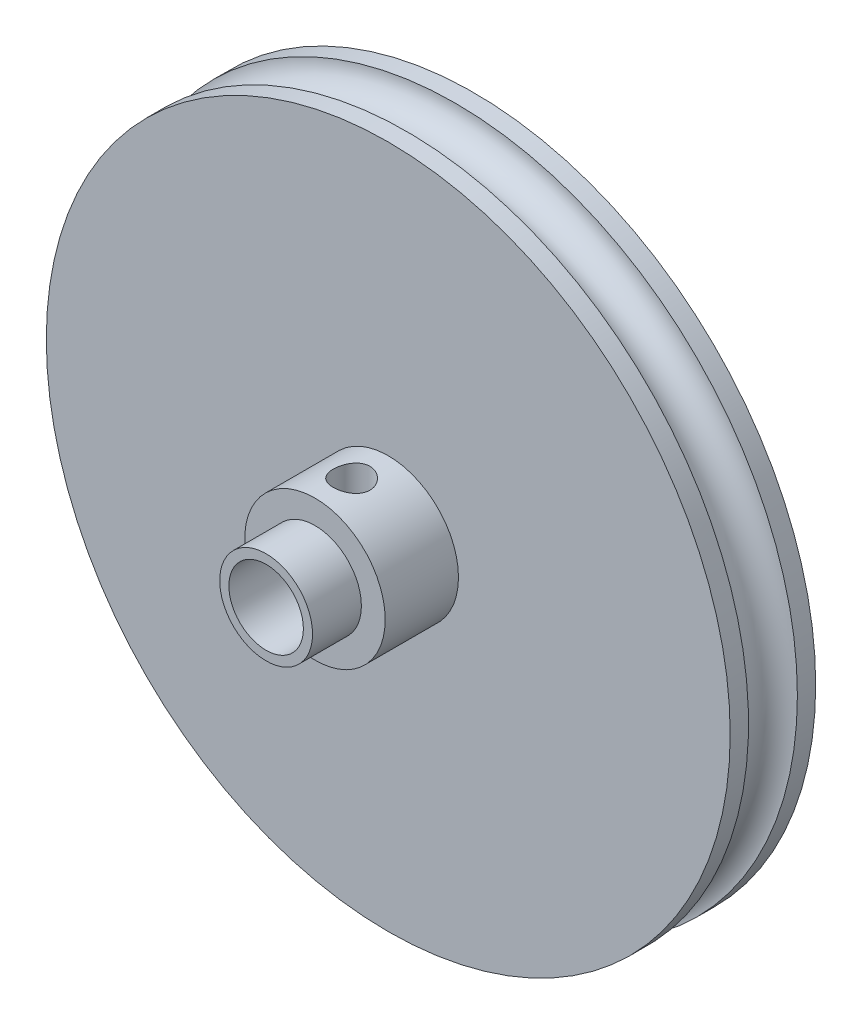
ISO-10303-21;
HEADER;
FILE_DESCRIPTION(('STEP AP214'),'2;1');
FILE_NAME('part.step','',(''),(''),'','','');
FILE_SCHEMA(('AUTOMOTIVE_DESIGN { 1 0 10303 214 1 1 1 1 }'));
ENDSEC;
DATA;
#1=APPLICATION_CONTEXT('core data for automotive mechanical design processes');
#2=APPLICATION_PROTOCOL_DEFINITION('international standard','automotive_design',2000,#1);
#3=PRODUCT_CONTEXT('',#1,'mechanical');
#4=PRODUCT('Part','Part','',(#3));
#5=PRODUCT_RELATED_PRODUCT_CATEGORY('part','',(#4));
#6=PRODUCT_DEFINITION_FORMATION('','',#4);
#7=PRODUCT_DEFINITION_CONTEXT('part definition',#1,'design');
#8=PRODUCT_DEFINITION('design','',#6,#7);
#9=PRODUCT_DEFINITION_SHAPE('','',#8);
#10=(LENGTH_UNIT() NAMED_UNIT(*) SI_UNIT(.MILLI.,.METRE.));
#11=(NAMED_UNIT(*) PLANE_ANGLE_UNIT() SI_UNIT($,.RADIAN.));
#12=(NAMED_UNIT(*) SI_UNIT($,.STERADIAN.) SOLID_ANGLE_UNIT());
#13=UNCERTAINTY_MEASURE_WITH_UNIT(LENGTH_MEASURE(1.E-05),#10,'distance_accuracy_value','');
#14=(GEOMETRIC_REPRESENTATION_CONTEXT(3) GLOBAL_UNCERTAINTY_ASSIGNED_CONTEXT((#13)) GLOBAL_UNIT_ASSIGNED_CONTEXT((#10,
#11,#12)) REPRESENTATION_CONTEXT('',''));
#15=CARTESIAN_POINT('',(0.,0.,0.));
#16=DIRECTION('',(0.,0.,1.));
#17=DIRECTION('',(1.,0.,0.));
#18=AXIS2_PLACEMENT_3D('',#15,#16,#17);
#19=CARTESIAN_POINT('',(0.,0.,0.));
#20=DIRECTION('',(0.,0.,1.));
#21=DIRECTION('',(1.,0.,0.));
#22=AXIS2_PLACEMENT_3D('',#19,#20,#21);
#23=CYLINDRICAL_SURFACE('',#22,3.05);
#24=CARTESIAN_POINT('',(0.,0.,0.));
#25=DIRECTION('',(0.,0.,1.));
#26=DIRECTION('',(1.,0.,0.));
#27=AXIS2_PLACEMENT_3D('',#24,#25,#26);
#28=CIRCLE('',#27,3.05);
#29=CARTESIAN_POINT('',(3.05,0.,0.));
#30=VERTEX_POINT('',#29);
#31=EDGE_CURVE('E72',#30,#30,#28,.T.);
#32=ORIENTED_EDGE('',*,*,#31,.F.);
#33=EDGE_LOOP('',(#32));
#34=FACE_BOUND('',#33,.T.);
#35=CARTESIAN_POINT('',(0.,0.,17.));
#36=DIRECTION('',(0.,0.,1.));
#37=DIRECTION('',(1.,0.,0.));
#38=AXIS2_PLACEMENT_3D('',#35,#36,#37);
#39=CIRCLE('',#38,3.05);
#40=CARTESIAN_POINT('',(3.05,0.,17.));
#41=VERTEX_POINT('',#40);
#42=EDGE_CURVE('E60',#41,#41,#39,.T.);
#43=ORIENTED_EDGE('',*,*,#42,.T.);
#44=EDGE_LOOP('',(#43));
#45=FACE_BOUND('',#44,.T.);
#46=CARTESIAN_POINT('',(0.,3.05,8.5));
#47=CARTESIAN_POINT('',(-0.0790121591152923,3.04999583004511,8.50000484120083));
#48=CARTESIAN_POINT('',(-0.158123109073971,3.046896548201,8.50627964370353));
#49=CARTESIAN_POINT('',(-0.314016583416219,3.03480421825573,8.53110593800192));
#50=CARTESIAN_POINT('',(-0.390794181005841,3.0257994984784,8.54968174255923));
#51=CARTESIAN_POINT('',(-0.53952603133641,3.00284084386658,8.59821300050884));
#52=CARTESIAN_POINT('',(-0.611497586074583,2.98890594310517,8.62812472022035));
#53=CARTESIAN_POINT('',(-0.749298788829614,2.95737299627623,8.6982572769953));
#54=CARTESIAN_POINT('',(-0.815129052260737,2.93977531782522,8.73847707957648));
#55=CARTESIAN_POINT('',(-0.943155735494706,2.90132469480607,8.83079151399698));
#56=CARTESIAN_POINT('',(-1.0049075857291,2.8803408420437,8.88344739125793));
#57=CARTESIAN_POINT('',(-1.11911097419106,2.83792333233935,8.99793391577625));
#58=CARTESIAN_POINT('',(-1.17155567217555,2.81648935741441,9.05977125009856));
#59=CARTESIAN_POINT('',(-1.26956299006292,2.77376596642839,9.19638943116436));
#60=CARTESIAN_POINT('',(-1.31432337024655,2.75260593052471,9.27179096110966));
#61=CARTESIAN_POINT('',(-1.39033808234539,2.71500839483475,9.43020809697973));
#62=CARTESIAN_POINT('',(-1.42160182487502,2.69856760721218,9.51321834855756));
#63=CARTESIAN_POINT('',(-1.46774162902549,2.67374062916046,9.67948832514222));
#64=CARTESIAN_POINT('',(-1.48347553054657,2.66493654619801,9.76244453401595));
#65=CARTESIAN_POINT('',(-1.50074333583008,2.65525496689311,9.93024815188139));
#66=CARTESIAN_POINT('',(-1.5022904683051,2.65437008616402,10.0150937250645));
#67=CARTESIAN_POINT('',(-1.49177147186588,2.66028863855358,10.1738072902588));
#68=CARTESIAN_POINT('',(-1.48124717164624,2.66622144482784,10.247817699759));
#69=CARTESIAN_POINT('',(-1.44954635251191,2.68358690044372,10.392845487931));
#70=CARTESIAN_POINT('',(-1.428366620188,2.695021208854,10.4638619566997));
#71=CARTESIAN_POINT('',(-1.37556056540335,2.72235753816344,10.6029067586163));
#72=CARTESIAN_POINT('',(-1.34370211631021,2.73835754043131,10.6708267680029));
#73=CARTESIAN_POINT('',(-1.27061880578483,2.77302396648056,10.8006779452731));
#74=CARTESIAN_POINT('',(-1.22938975117738,2.79169158257788,10.8626064143104));
#75=CARTESIAN_POINT('',(-1.13285916778918,2.8323474628681,10.9866803470019));
#76=CARTESIAN_POINT('',(-1.07645386981942,2.85446281808634,11.0479283811758));
#77=CARTESIAN_POINT('',(-0.954065870504519,2.89766631706263,11.1604623420124));
#78=CARTESIAN_POINT('',(-0.888078896501354,2.9187539969274,11.2117438004008));
#79=CARTESIAN_POINT('',(-0.744746849491983,2.9586509919318,11.3049788350952));
#80=CARTESIAN_POINT('',(-0.667032143608022,2.97732098755061,11.3464285803872));
#81=CARTESIAN_POINT('',(-0.504580978027578,3.00910722350543,11.4153322195505));
#82=CARTESIAN_POINT('',(-0.419849980776133,3.0222277366041,11.4427968844141));
#83=CARTESIAN_POINT('',(-0.253132327676634,3.04053930862384,11.480753451874));
#84=CARTESIAN_POINT('',(-0.171479246182072,3.04628654107217,11.4924398908905));
#85=CARTESIAN_POINT('',(-0.00718038449540026,3.05109656535608,11.5022355078072));
#86=CARTESIAN_POINT('',(0.0754649311114703,3.05016237239533,11.5003508101079));
#87=CARTESIAN_POINT('',(0.232867008562215,3.04204300882746,11.4837684174168));
#88=CARTESIAN_POINT('',(0.307753039671982,3.03532832472173,11.4700349391487));
#89=CARTESIAN_POINT('',(0.454014036617752,3.01692009404667,11.4316388747035));
#90=CARTESIAN_POINT('',(0.525388608627639,3.00522599042641,11.4069750657306));
#91=CARTESIAN_POINT('',(0.665008831118594,2.97749566405385,11.346742224404));
#92=CARTESIAN_POINT('',(0.733101965032084,2.96134247431089,11.3108754061223));
#93=CARTESIAN_POINT('',(0.862533383747499,2.92626721384168,11.2295867248632));
#94=CARTESIAN_POINT('',(0.923868736619219,2.90734394951753,11.184160739224));
#95=CARTESIAN_POINT('',(1.04426381968072,2.86643192053389,11.0800183661383));
#96=CARTESIAN_POINT('',(1.10254382684059,2.84432310423,11.0204460528996));
#97=CARTESIAN_POINT('',(1.20861844389017,2.80089867887462,10.8922820941079));
#98=CARTESIAN_POINT('',(1.25640638160683,2.77958358168146,10.8236847533922));
#99=CARTESIAN_POINT('',(1.3421089910013,2.73926797211215,10.675558752652));
#100=CARTESIAN_POINT('',(1.37949374278177,2.72041145439757,10.5956808872091));
#101=CARTESIAN_POINT('',(1.43989036363054,2.68893908087369,10.4295377787429));
#102=CARTESIAN_POINT('',(1.46292014490625,2.67631545174084,10.3432806468347));
#103=CARTESIAN_POINT('',(1.49187949324441,2.660271602964,10.1755937534308));
#104=CARTESIAN_POINT('',(1.49922397672405,2.65609192898552,10.094482265139));
#105=CARTESIAN_POINT('',(1.50065809196884,2.65528337040461,9.93211810065062));
#106=CARTESIAN_POINT('',(1.49475287695536,2.65865155020558,9.85086549162213));
#107=CARTESIAN_POINT('',(1.47116686852984,2.67176347047332,9.69816876464186));
#108=CARTESIAN_POINT('',(1.45458598272049,2.6809103300925,9.62649715823401));
#109=CARTESIAN_POINT('',(1.411447509843,2.70386933278689,9.48701989128498));
#110=CARTESIAN_POINT('',(1.38488678919479,2.71768294104244,9.41921545271043));
#111=CARTESIAN_POINT('',(1.32053483396429,2.7495557215134,9.28435954000751));
#112=CARTESIAN_POINT('',(1.28210845606534,2.7678379392928,9.21766537030659));
#113=CARTESIAN_POINT('',(1.19583480791246,2.80619087113744,9.09124114139267));
#114=CARTESIAN_POINT('',(1.14798273364253,2.8262624943455,9.03151465823586));
#115=CARTESIAN_POINT('',(1.03769302652812,2.86872322594616,8.91351588834033));
#116=CARTESIAN_POINT('',(0.974206985140172,2.89111082224701,8.85621764672704));
#117=CARTESIAN_POINT('',(0.837867967477372,2.93352516398325,8.75288621098039));
#118=CARTESIAN_POINT('',(0.765010156468472,2.95355068056853,8.70685886714674));
#119=CARTESIAN_POINT('',(0.611307780499878,2.98915484856843,8.62748004547963));
#120=CARTESIAN_POINT('',(0.53043538296126,3.00471721666241,8.59417483998915));
#121=CARTESIAN_POINT('',(0.363354285900161,3.02944720863458,8.5420618587597));
#122=CARTESIAN_POINT('',(0.277161725348729,3.0386332285355,8.52321236108469));
#123=CARTESIAN_POINT('',(0.15843983765776,3.04604704373756,8.50805183115236));
#124=CARTESIAN_POINT('',(0.126851029159839,3.04752578314267,8.50503639084874));
#125=CARTESIAN_POINT('',(0.0635134722445766,3.04950311268857,8.50100947513595));
#126=CARTESIAN_POINT('',(0.0317647195406482,3.05000167641853,8.49999805372505));
#127=CARTESIAN_POINT('',(0.,3.05,8.5));
#128=B_SPLINE_CURVE_WITH_KNOTS('',3,(#46,#47,#48,#49,#50,#51,#52,#53,#54,#55,#56,#57,#58,#59,
#60,#61,#62,#63,#64,#65,#66,#67,#68,#69,#70,#71,#72,#73,#74,#75,#76,#77,#78,#79,#80,#81,#82,#83,
#84,#85,#86,#87,#88,#89,#90,#91,#92,#93,#94,#95,#96,#97,#98,#99,#100,#101,#102,#103,#104,#105,
#106,#107,#108,#109,#110,#111,#112,#113,#114,#115,#116,#117,#118,#119,#120,#121,#122,#123,#124,
#125,#126,#127),.UNSPECIFIED.,.T.,.F.,(4,2,2,2,2,2,2,2,2,2,2,2,2,2,2,2,2,2,2,2,2,2,2,2,2,2,2,2,
2,2,2,2,2,2,2,2,2,2,2,2,4),(0.,0.236907372897791,0.474284393140897,0.710754790641297,
0.94720146610623,1.19761958815993,1.4482209983207,1.71746566582587,1.98652229640536,
2.23970891188761,2.49265941483855,2.71658234199466,2.94057283916633,3.16978750902539,
3.39910495092324,3.65643235059265,3.91387485202246,4.18253534165072,4.45098860089529,
4.69769846781158,4.94429700615677,5.17253924831825,5.40080703080073,5.63574946457177,
5.87079343235401,6.12833457451086,6.38603902226841,6.65513695160489,6.92389842339302,
7.16716472318342,7.41033642551692,7.63176906490667,7.85327129037239,8.08966993889541,
8.32618938647136,8.59017101263584,8.85428937267184,9.1193594260599,9.3836615270369,
9.47890121648049,9.57414347212154),.UNSPECIFIED.);
#129=CARTESIAN_POINT('',(0.,3.05,8.5));
#130=VERTEX_POINT('',#129);
#131=EDGE_CURVE('E129',#130,#130,#128,.T.);
#132=ORIENTED_EDGE('',*,*,#131,.T.);
#133=EDGE_LOOP('',(#132));
#134=FACE_BOUND('',#133,.T.);
#135=ADVANCED_FACE('F37',(#34,#45,#134),#23,.F.);
#136=CARTESIAN_POINT('',(0.,0.,13.));
#137=DIRECTION('',(0.,0.,-1.));
#138=DIRECTION('',(-1.,0.,0.));
#139=AXIS2_PLACEMENT_3D('',#136,#137,#138);
#140=CYLINDRICAL_SURFACE('',#139,5.75);
#141=CARTESIAN_POINT('',(0.,0.,13.));
#142=DIRECTION('',(0.,0.,1.));
#143=DIRECTION('',(1.,0.,0.));
#144=AXIS2_PLACEMENT_3D('',#141,#142,#143);
#145=CIRCLE('',#144,5.75);
#146=CARTESIAN_POINT('',(5.75,0.,13.));
#147=VERTEX_POINT('',#146);
#148=EDGE_CURVE('E56',#147,#147,#145,.T.);
#149=ORIENTED_EDGE('',*,*,#148,.F.);
#150=EDGE_LOOP('',(#149));
#151=FACE_BOUND('',#150,.T.);
#152=CARTESIAN_POINT('',(0.,0.,7.));
#153=DIRECTION('',(0.,0.,1.));
#154=DIRECTION('',(1.,0.,0.));
#155=AXIS2_PLACEMENT_3D('',#152,#153,#154);
#156=CIRCLE('',#155,5.75);
#157=CARTESIAN_POINT('',(5.75,0.,7.));
#158=VERTEX_POINT('',#157);
#159=EDGE_CURVE('E62',#158,#158,#156,.T.);
#160=ORIENTED_EDGE('',*,*,#159,.T.);
#161=EDGE_LOOP('',(#160));
#162=FACE_BOUND('',#161,.T.);
#163=CARTESIAN_POINT('',(0.,5.75,8.5));
#164=CARTESIAN_POINT('',(0.0827565504301497,5.74999869210413,8.50000209693434));
#165=CARTESIAN_POINT('',(0.165535896333785,5.74819573678926,8.50687163655909));
#166=CARTESIAN_POINT('',(0.328714260063833,5.74117834518274,8.53412231590813));
#167=CARTESIAN_POINT('',(0.409112038400621,5.73596216398353,8.55451036662962));
#168=CARTESIAN_POINT('',(0.565147916645536,5.72269471803663,8.60809337090641));
#169=CARTESIAN_POINT('',(0.640791866299035,5.71464702139503,8.64127221128726));
#170=CARTESIAN_POINT('',(0.785441100183015,5.6965693697918,8.71943630696442));
#171=CARTESIAN_POINT('',(0.854446018094282,5.68653930554301,8.76442221322454));
#172=CARTESIAN_POINT('',(0.985395243676024,5.66533217333061,8.8659814469638));
#173=CARTESIAN_POINT('',(1.04717061891579,5.65413616833994,8.92276864635182));
#174=CARTESIAN_POINT('',(1.16043774099598,5.63198208961254,9.04586104532487));
#175=CARTESIAN_POINT('',(1.21192822336676,5.62102404527915,9.11216741351781));
#176=CARTESIAN_POINT('',(1.30397724199551,5.60039389168282,9.25375134761141));
#177=CARTESIAN_POINT('',(1.34434334141883,5.59074572831206,9.32915783233057));
#178=CARTESIAN_POINT('',(1.41175895890956,5.57410537320255,9.48597925944645));
#179=CARTESIAN_POINT('',(1.43881081557756,5.56711271508282,9.56739314377334));
#180=CARTESIAN_POINT('',(1.47824702752585,5.55677031015972,9.73205207693459));
#181=CARTESIAN_POINT('',(1.4909367764617,5.55334484273862,9.81521911320192));
#182=CARTESIAN_POINT('',(1.50224036987484,5.55029828055544,9.98256671426479));
#183=CARTESIAN_POINT('',(1.50085672263456,5.55067650786586,10.0667470957819));
#184=CARTESIAN_POINT('',(1.48429567965221,5.55512672552155,10.2313635488845));
#185=CARTESIAN_POINT('',(1.46948580722496,5.55910029308473,10.3118396759388));
#186=CARTESIAN_POINT('',(1.42708051177426,5.57013613953299,10.4691235497515));
#187=CARTESIAN_POINT('',(1.39948410614448,5.57719865579208,10.5459310140837));
#188=CARTESIAN_POINT('',(1.33198478786635,5.5937045163537,10.6946650061616));
#189=CARTESIAN_POINT('',(1.29195142735603,5.60317289375448,10.7665294381369));
#190=CARTESIAN_POINT('',(1.20080568188756,5.62340993425445,10.9026505986828));
#191=CARTESIAN_POINT('',(1.14969120122697,5.63417884314409,10.9669058846243));
#192=CARTESIAN_POINT('',(1.03594627958334,5.65621492770398,11.0880868684054));
#193=CARTESIAN_POINT('',(0.9730066664485,5.66748717408484,11.1447218365863));
#194=CARTESIAN_POINT('',(0.838386315191362,5.68895837312073,11.246691023225));
#195=CARTESIAN_POINT('',(0.766705261397836,5.69915728699075,11.2920248333949));
#196=CARTESIAN_POINT('',(0.616199144394334,5.71739102831751,11.3702252493992));
#197=CARTESIAN_POINT('',(0.537346599066203,5.72541701813719,11.4030411576181));
#198=CARTESIAN_POINT('',(0.374987203608011,5.73833660089413,11.4548683990326));
#199=CARTESIAN_POINT('',(0.291481329325966,5.74323084792075,11.473882614933));
#200=CARTESIAN_POINT('',(0.12466844814518,5.74923732985035,11.4971146775189));
#201=CARTESIAN_POINT('',(0.0414200784096534,5.75045062870886,11.5017280193963));
#202=CARTESIAN_POINT('',(-0.124660236000428,5.74924810980225,11.4971169376547));
#203=CARTESIAN_POINT('',(-0.207492220924062,5.74683264984631,11.4878938783566));
#204=CARTESIAN_POINT('',(-0.368990098986061,5.73870911781798,11.4561967953961));
#205=CARTESIAN_POINT('',(-0.447701939255478,5.73305546646209,11.4339416525768));
#206=CARTESIAN_POINT('',(-0.600268715228635,5.71909531448199,11.3770648411489));
#207=CARTESIAN_POINT('',(-0.674123135616293,5.71078853293703,11.3424418629537));
#208=CARTESIAN_POINT('',(-0.816428443616214,5.69220484598953,11.2610669954068));
#209=CARTESIAN_POINT('',(-0.884750411419281,5.68189358941189,11.2140976943347));
#210=CARTESIAN_POINT('',(-1.01268222253221,5.66049369913368,11.1096383923464));
#211=CARTESIAN_POINT('',(-1.07229041806259,5.64940491898805,11.0521464062013));
#212=CARTESIAN_POINT('',(-1.18275627994778,5.6273307326366,10.9264311721429));
#213=CARTESIAN_POINT('',(-1.23333544423787,5.61635612995624,10.8579608680037));
#214=CARTESIAN_POINT('',(-1.3222896776832,5.5960825093024,10.7132743901058));
#215=CARTESIAN_POINT('',(-1.36066527119569,5.58678341934373,10.6370585493393));
#216=CARTESIAN_POINT('',(-1.42383428632845,5.57101932883981,10.4794370807867));
#217=CARTESIAN_POINT('',(-1.44870733752349,5.5645377585197,10.398065111417));
#218=CARTESIAN_POINT('',(-1.48436197994454,5.55513419747947,10.2320970746916));
#219=CARTESIAN_POINT('',(-1.49514698498135,5.5522113444238,10.1475017935233));
#220=CARTESIAN_POINT('',(-1.50212929714525,5.55032597891716,9.98033352927471));
#221=CARTESIAN_POINT('',(-1.49877331702716,5.55124218564566,9.89778028650471));
#222=CARTESIAN_POINT('',(-1.47860023277945,5.55664900804772,9.7344606280366));
#223=CARTESIAN_POINT('',(-1.46178344725374,5.56113953912056,9.65369417009355));
#224=CARTESIAN_POINT('',(-1.41541989316566,5.57311845404139,9.49677581677364));
#225=CARTESIAN_POINT('',(-1.38596393084726,5.58058542694998,9.42059534300181));
#226=CARTESIAN_POINT('',(-1.31522905504201,5.59767724921601,9.27420105076281));
#227=CARTESIAN_POINT('',(-1.273948361164,5.6073024234757,9.20398813286678));
#228=CARTESIAN_POINT('',(-1.17936548934914,5.62796582443248,9.06938035166689));
#229=CARTESIAN_POINT('',(-1.12575664428232,5.63903628879905,9.00520588752847));
#230=CARTESIAN_POINT('',(-1.00862756716089,5.66115857831811,8.88661858880262));
#231=CARTESIAN_POINT('',(-0.94510495002805,5.67221039833667,8.83220811004711));
#232=CARTESIAN_POINT('',(-0.808402581432237,5.69331699830976,8.7336156116059));
#233=CARTESIAN_POINT('',(-0.735053640266801,5.70334712127171,8.68966247041353));
#234=CARTESIAN_POINT('',(-0.581750060014079,5.72101404443558,8.61478043939368));
#235=CARTESIAN_POINT('',(-0.50179987983651,5.72865244372007,8.58384284272776));
#236=CARTESIAN_POINT('',(-0.351741777794353,5.73963699654114,8.54010420641963));
#237=CARTESIAN_POINT('',(-0.282305646729965,5.74349538660568,8.52509918594351));
#238=CARTESIAN_POINT('',(-0.141918507101204,5.74867733519136,8.50504663119056));
#239=CARTESIAN_POINT('',(-0.0709676352972892,5.75000112158224,8.49999820178015));
#240=CARTESIAN_POINT('',(0.,5.75,8.5));
#241=B_SPLINE_CURVE_WITH_KNOTS('',3,(#163,#164,#165,#166,#167,#168,#169,#170,#171,#172,#173,
#174,#175,#176,#177,#178,#179,#180,#181,#182,#183,#184,#185,#186,#187,#188,#189,#190,#191,#192,
#193,#194,#195,#196,#197,#198,#199,#200,#201,#202,#203,#204,#205,#206,#207,#208,#209,#210,#211,
#212,#213,#214,#215,#216,#217,#218,#219,#220,#221,#222,#223,#224,#225,#226,#227,#228,#229,#230,
#231,#232,#233,#234,#235,#236,#237,#238,#239,#240),.UNSPECIFIED.,.T.,.F.,(4,2,2,2,2,2,2,2,2,2,2,
2,2,2,2,2,2,2,2,2,2,2,2,2,2,2,2,2,2,2,2,2,2,2,2,2,2,2,4),(0.,0.248009461318893,
0.496145809063828,0.743970583594285,0.991809024421142,1.24460721819603,1.49743647298028,
1.75439818241906,2.01131474130253,2.26265911775352,2.51395869822046,2.75858040416548,
3.00322091166615,3.25051934152511,3.49786458224273,3.7529160379782,4.00797670687022,
4.26405967513086,4.520089140957,4.76902239537675,5.01793110565878,5.2627745289135,
5.50764388546504,5.75715356277692,6.00671036165089,6.26297981565022,6.51923825689677,
6.7739685583984,7.02863712227793,7.27532204322615,7.52200112555968,7.76693685868474,
8.01190948996992,8.26380271891957,8.5157566426103,8.7728012919595,9.02967371503768,
9.24237261906137,9.45505239981192),.UNSPECIFIED.);
#242=CARTESIAN_POINT('',(0.,5.75,8.5));
#243=VERTEX_POINT('',#242);
#244=EDGE_CURVE('E125',#243,#243,#241,.T.);
#245=ORIENTED_EDGE('',*,*,#244,.T.);
#246=EDGE_LOOP('',(#245));
#247=FACE_BOUND('',#246,.T.);
#248=ADVANCED_FACE('F99',(#151,#162,#247),#140,.T.);
#249=CARTESIAN_POINT('',(0.,0.,7.));
#250=DIRECTION('',(0.,0.,1.));
#251=DIRECTION('',(1.,0.,0.));
#252=AXIS2_PLACEMENT_3D('',#249,#250,#251);
#253=PLANE('',#252);
#254=CARTESIAN_POINT('',(0.,0.,7.));
#255=DIRECTION('',(0.,0.,1.));
#256=DIRECTION('',(1.,0.,0.));
#257=AXIS2_PLACEMENT_3D('',#254,#255,#256);
#258=CIRCLE('',#257,28.);
#259=CARTESIAN_POINT('',(28.,0.,7.));
#260=VERTEX_POINT('',#259);
#261=EDGE_CURVE('E10',#260,#260,#258,.T.);
#262=ORIENTED_EDGE('',*,*,#261,.T.);
#263=EDGE_LOOP('',(#262));
#264=FACE_BOUND('',#263,.T.);
#265=ORIENTED_EDGE('',*,*,#159,.F.);
#266=EDGE_LOOP('',(#265));
#267=FACE_BOUND('',#266,.T.);
#268=ADVANCED_FACE('F105',(#264,#267),#253,.T.);
#269=CARTESIAN_POINT('',(0.,0.,7.));
#270=DIRECTION('',(0.,0.,-1.));
#271=DIRECTION('',(-1.,0.,0.));
#272=AXIS2_PLACEMENT_3D('',#269,#270,#271);
#273=CYLINDRICAL_SURFACE('',#272,28.);
#274=CARTESIAN_POINT('',(0.,0.,1.5));
#275=DIRECTION('',(0.,0.,1.));
#276=DIRECTION('',(1.,0.,0.));
#277=AXIS2_PLACEMENT_3D('',#274,#275,#276);
#278=CIRCLE('',#277,28.);
#279=CARTESIAN_POINT('',(28.,0.,1.5));
#280=VERTEX_POINT('',#279);
#281=EDGE_CURVE('E41',#280,#280,#278,.F.);
#282=ORIENTED_EDGE('',*,*,#281,.T.);
#283=EDGE_LOOP('',(#282));
#284=FACE_BOUND('',#283,.T.);
#285=CARTESIAN_POINT('',(0.,0.,0.));
#286=DIRECTION('',(0.,0.,1.));
#287=DIRECTION('',(1.,0.,0.));
#288=AXIS2_PLACEMENT_3D('',#285,#286,#287);
#289=CIRCLE('',#288,28.);
#290=CARTESIAN_POINT('',(28.,0.,0.));
#291=VERTEX_POINT('',#290);
#292=EDGE_CURVE('E45',#291,#291,#289,.T.);
#293=ORIENTED_EDGE('',*,*,#292,.T.);
#294=EDGE_LOOP('',(#293));
#295=FACE_BOUND('',#294,.T.);
#296=ADVANCED_FACE('F170',(#284,#295),#273,.T.);
#297=CARTESIAN_POINT('',(0.,0.,5.5));
#298=DIRECTION('',(0.,0.,-1.));
#299=DIRECTION('',(-1.,0.,0.));
#300=AXIS2_PLACEMENT_3D('',#297,#298,#299);
#301=CIRCLE('',#300,28.);
#302=CARTESIAN_POINT('',(-28.,0.,5.5));
#303=VERTEX_POINT('',#302);
#304=EDGE_CURVE('E54',#303,#303,#301,.F.);
#305=ORIENTED_EDGE('',*,*,#304,.T.);
#306=EDGE_LOOP('',(#305));
#307=FACE_BOUND('',#306,.T.);
#308=ORIENTED_EDGE('',*,*,#261,.F.);
#309=EDGE_LOOP('',(#308));
#310=FACE_BOUND('',#309,.T.);
#311=ADVANCED_FACE('F39',(#307,#310),#273,.T.);
#312=CARTESIAN_POINT('',(0.,0.,0.));
#313=DIRECTION('',(0.,0.,1.));
#314=DIRECTION('',(1.,0.,0.));
#315=AXIS2_PLACEMENT_3D('',#312,#313,#314);
#316=PLANE('',#315);
#317=ORIENTED_EDGE('',*,*,#31,.T.);
#318=EDGE_LOOP('',(#317));
#319=FACE_BOUND('',#318,.T.);
#320=ORIENTED_EDGE('',*,*,#292,.F.);
#321=EDGE_LOOP('',(#320));
#322=FACE_BOUND('',#321,.T.);
#323=ADVANCED_FACE('F89',(#319,#322),#316,.F.);
#324=CARTESIAN_POINT('',(0.,0.,17.));
#325=DIRECTION('',(0.,0.,-1.));
#326=DIRECTION('',(-1.,0.,0.));
#327=AXIS2_PLACEMENT_3D('',#324,#325,#326);
#328=CYLINDRICAL_SURFACE('',#327,3.8);
#329=CARTESIAN_POINT('',(0.,0.,13.));
#330=DIRECTION('',(0.,0.,1.));
#331=DIRECTION('',(1.,0.,0.));
#332=AXIS2_PLACEMENT_3D('',#329,#330,#331);
#333=CIRCLE('',#332,3.8);
#334=CARTESIAN_POINT('',(3.8,0.,13.));
#335=VERTEX_POINT('',#334);
#336=EDGE_CURVE('E67',#335,#335,#333,.T.);
#337=ORIENTED_EDGE('',*,*,#336,.T.);
#338=EDGE_LOOP('',(#337));
#339=FACE_BOUND('',#338,.T.);
#340=CARTESIAN_POINT('',(0.,0.,17.));
#341=DIRECTION('',(0.,0.,1.));
#342=DIRECTION('',(1.,0.,0.));
#343=AXIS2_PLACEMENT_3D('',#340,#341,#342);
#344=CIRCLE('',#343,3.8);
#345=CARTESIAN_POINT('',(3.8,0.,17.));
#346=VERTEX_POINT('',#345);
#347=EDGE_CURVE('E50',#346,#346,#344,.T.);
#348=ORIENTED_EDGE('',*,*,#347,.F.);
#349=EDGE_LOOP('',(#348));
#350=FACE_BOUND('',#349,.T.);
#351=ADVANCED_FACE('F83',(#339,#350),#328,.T.);
#352=CARTESIAN_POINT('',(0.,0.,17.));
#353=DIRECTION('',(0.,0.,1.));
#354=DIRECTION('',(1.,0.,0.));
#355=AXIS2_PLACEMENT_3D('',#352,#353,#354);
#356=PLANE('',#355);
#357=ORIENTED_EDGE('',*,*,#42,.F.);
#358=EDGE_LOOP('',(#357));
#359=FACE_BOUND('',#358,.T.);
#360=ORIENTED_EDGE('',*,*,#347,.T.);
#361=EDGE_LOOP('',(#360));
#362=FACE_BOUND('',#361,.T.);
#363=ADVANCED_FACE('F79',(#359,#362),#356,.T.);
#364=CARTESIAN_POINT('',(0.,0.,3.5));
#365=DIRECTION('',(0.,0.,-1.));
#366=DIRECTION('',(-1.,0.,0.));
#367=AXIS2_PLACEMENT_3D('',#364,#365,#366);
#368=TOROIDAL_SURFACE('',#367,28.,2.);
#369=ORIENTED_EDGE('',*,*,#304,.F.);
#370=EDGE_LOOP('',(#369));
#371=FACE_BOUND('',#370,.T.);
#372=ORIENTED_EDGE('',*,*,#281,.F.);
#373=EDGE_LOOP('',(#372));
#374=FACE_BOUND('',#373,.T.);
#375=ADVANCED_FACE('F82',(#371,#374),#368,.F.);
#376=CARTESIAN_POINT('',(0.,0.,13.));
#377=DIRECTION('',(0.,0.,1.));
#378=DIRECTION('',(1.,0.,0.));
#379=AXIS2_PLACEMENT_3D('',#376,#377,#378);
#380=PLANE('',#379);
#381=ORIENTED_EDGE('',*,*,#148,.T.);
#382=EDGE_LOOP('',(#381));
#383=FACE_BOUND('',#382,.T.);
#384=ORIENTED_EDGE('',*,*,#336,.F.);
#385=EDGE_LOOP('',(#384));
#386=FACE_BOUND('',#385,.T.);
#387=ADVANCED_FACE('F111',(#383,#386),#380,.T.);
#388=CARTESIAN_POINT('',(0.,28.001,10.));
#389=DIRECTION('',(0.,-1.,0.));
#390=DIRECTION('',(0.,0.,-1.));
#391=AXIS2_PLACEMENT_3D('',#388,#389,#390);
#392=CYLINDRICAL_SURFACE('',#391,1.5);
#393=ORIENTED_EDGE('',*,*,#244,.F.);
#394=EDGE_LOOP('',(#393));
#395=FACE_BOUND('',#394,.T.);
#396=ORIENTED_EDGE('',*,*,#131,.F.);
#397=EDGE_LOOP('',(#396));
#398=FACE_BOUND('',#397,.T.);
#399=ADVANCED_FACE('F116',(#395,#398),#392,.F.);
#400=CLOSED_SHELL('',(#135,#248,#268,#296,#311,#323,#351,#363,#375,#387,#399));
#401=MANIFOLD_SOLID_BREP('B2',#400);
#402=ADVANCED_BREP_SHAPE_REPRESENTATION('',(#18,#401),#14);
#403=SHAPE_DEFINITION_REPRESENTATION(#9,#402);
ENDSEC;
END-ISO-10303-21;
